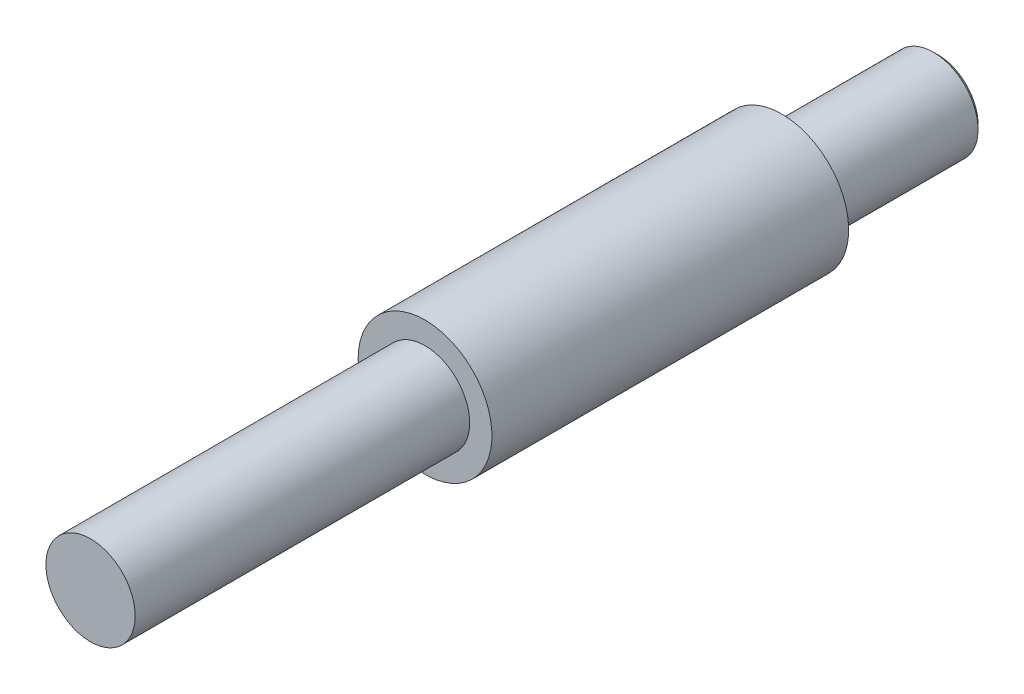
ISO-10303-21;
HEADER;
FILE_DESCRIPTION(('STEP AP214'),'2;1');
FILE_NAME('part.step','',(''),(''),'','','');
FILE_SCHEMA(('AUTOMOTIVE_DESIGN { 1 0 10303 214 1 1 1 1 }'));
ENDSEC;
DATA;
#1=APPLICATION_CONTEXT('core data for automotive mechanical design processes');
#2=APPLICATION_PROTOCOL_DEFINITION('international standard','automotive_design',2000,#1);
#3=PRODUCT_CONTEXT('',#1,'mechanical');
#4=PRODUCT('Part','Part','',(#3));
#5=PRODUCT_RELATED_PRODUCT_CATEGORY('part','',(#4));
#6=PRODUCT_DEFINITION_FORMATION('','',#4);
#7=PRODUCT_DEFINITION_CONTEXT('part definition',#1,'design');
#8=PRODUCT_DEFINITION('design','',#6,#7);
#9=PRODUCT_DEFINITION_SHAPE('','',#8);
#10=(LENGTH_UNIT() NAMED_UNIT(*) SI_UNIT(.MILLI.,.METRE.));
#11=(NAMED_UNIT(*) PLANE_ANGLE_UNIT() SI_UNIT($,.RADIAN.));
#12=(NAMED_UNIT(*) SI_UNIT($,.STERADIAN.) SOLID_ANGLE_UNIT());
#13=UNCERTAINTY_MEASURE_WITH_UNIT(LENGTH_MEASURE(1.E-05),#10,'distance_accuracy_value','');
#14=(GEOMETRIC_REPRESENTATION_CONTEXT(3) GLOBAL_UNCERTAINTY_ASSIGNED_CONTEXT((#13)) GLOBAL_UNIT_ASSIGNED_CONTEXT((#10,
#11,#12)) REPRESENTATION_CONTEXT('',''));
#15=CARTESIAN_POINT('',(0.,0.,0.));
#16=DIRECTION('',(0.,0.,1.));
#17=DIRECTION('',(1.,0.,0.));
#18=AXIS2_PLACEMENT_3D('',#15,#16,#17);
#19=CARTESIAN_POINT('',(0.,0.,-75.));
#20=DIRECTION('',(0.,0.,1.));
#21=DIRECTION('',(1.,0.,0.));
#22=AXIS2_PLACEMENT_3D('',#19,#20,#21);
#23=CYLINDRICAL_SURFACE('',#22,10.01);
#24=CARTESIAN_POINT('',(0.,0.,-75.));
#25=DIRECTION('',(0.,0.,1.));
#26=DIRECTION('',(1.,0.,0.));
#27=AXIS2_PLACEMENT_3D('',#24,#25,#26);
#28=CIRCLE('',#27,10.01);
#29=CARTESIAN_POINT('',(10.01,0.,-75.));
#30=VERTEX_POINT('',#29);
#31=EDGE_CURVE('E67',#30,#30,#28,.T.);
#32=ORIENTED_EDGE('',*,*,#31,.T.);
#33=EDGE_LOOP('',(#32));
#34=FACE_BOUND('',#33,.T.);
#35=CARTESIAN_POINT('',(0.,0.,0.));
#36=DIRECTION('',(0.,0.,1.));
#37=DIRECTION('',(1.,0.,0.));
#38=AXIS2_PLACEMENT_3D('',#35,#36,#37);
#39=CIRCLE('',#38,10.01);
#40=CARTESIAN_POINT('',(10.01,0.,0.));
#41=VERTEX_POINT('',#40);
#42=EDGE_CURVE('E61',#41,#41,#39,.T.);
#43=ORIENTED_EDGE('',*,*,#42,.F.);
#44=EDGE_LOOP('',(#43));
#45=FACE_BOUND('',#44,.T.);
#46=ADVANCED_FACE('F40',(#34,#45),#23,.T.);
#47=CARTESIAN_POINT('',(0.,0.,0.));
#48=DIRECTION('',(0.,0.,1.));
#49=DIRECTION('',(1.,0.,0.));
#50=AXIS2_PLACEMENT_3D('',#47,#48,#49);
#51=PLANE('',#50);
#52=ORIENTED_EDGE('',*,*,#42,.T.);
#53=EDGE_LOOP('',(#52));
#54=FACE_BOUND('',#53,.T.);
#55=ADVANCED_FACE('F86',(#54),#51,.T.);
#56=CARTESIAN_POINT('',(0.,0.,-155.));
#57=DIRECTION('',(0.,0.,1.));
#58=DIRECTION('',(1.,0.,0.));
#59=AXIS2_PLACEMENT_3D('',#56,#57,#58);
#60=CYLINDRICAL_SURFACE('',#59,15.);
#61=CARTESIAN_POINT('',(0.,0.,-155.));
#62=DIRECTION('',(0.,0.,-1.));
#63=DIRECTION('',(-1.,0.,0.));
#64=AXIS2_PLACEMENT_3D('',#61,#62,#63);
#65=CIRCLE('',#64,15.);
#66=CARTESIAN_POINT('',(-15.,0.,-155.));
#67=VERTEX_POINT('',#66);
#68=EDGE_CURVE('E71',#67,#67,#65,.T.);
#69=ORIENTED_EDGE('',*,*,#68,.F.);
#70=EDGE_LOOP('',(#69));
#71=FACE_BOUND('',#70,.T.);
#72=CARTESIAN_POINT('',(0.,0.,-75.));
#73=DIRECTION('',(0.,0.,-1.));
#74=DIRECTION('',(-1.,0.,0.));
#75=AXIS2_PLACEMENT_3D('',#72,#73,#74);
#76=CIRCLE('',#75,15.);
#77=CARTESIAN_POINT('',(-15.,0.,-75.));
#78=VERTEX_POINT('',#77);
#79=EDGE_CURVE('E72',#78,#78,#76,.T.);
#80=ORIENTED_EDGE('',*,*,#79,.T.);
#81=EDGE_LOOP('',(#80));
#82=FACE_BOUND('',#81,.T.);
#83=ADVANCED_FACE('F83',(#71,#82),#60,.T.);
#84=CARTESIAN_POINT('',(0.,0.,-155.));
#85=DIRECTION('',(0.,0.,-1.));
#86=DIRECTION('',(-1.,0.,0.));
#87=AXIS2_PLACEMENT_3D('',#84,#85,#86);
#88=PLANE('',#87);
#89=CARTESIAN_POINT('',(0.,0.,-155.));
#90=DIRECTION('',(0.,0.,-1.));
#91=DIRECTION('',(-1.,0.,0.));
#92=AXIS2_PLACEMENT_3D('',#89,#90,#91);
#93=CIRCLE('',#92,10.01);
#94=CARTESIAN_POINT('',(-10.01,0.,-155.));
#95=VERTEX_POINT('',#94);
#96=EDGE_CURVE('E55',#95,#95,#93,.T.);
#97=ORIENTED_EDGE('',*,*,#96,.F.);
#98=EDGE_LOOP('',(#97));
#99=FACE_BOUND('',#98,.T.);
#100=ORIENTED_EDGE('',*,*,#68,.T.);
#101=EDGE_LOOP('',(#100));
#102=FACE_BOUND('',#101,.T.);
#103=ADVANCED_FACE('F81',(#99,#102),#88,.T.);
#104=CARTESIAN_POINT('',(0.,0.,-75.));
#105=DIRECTION('',(0.,0.,-1.));
#106=DIRECTION('',(-1.,0.,0.));
#107=AXIS2_PLACEMENT_3D('',#104,#105,#106);
#108=PLANE('',#107);
#109=ORIENTED_EDGE('',*,*,#31,.F.);
#110=EDGE_LOOP('',(#109));
#111=FACE_BOUND('',#110,.T.);
#112=ORIENTED_EDGE('',*,*,#79,.F.);
#113=EDGE_LOOP('',(#112));
#114=FACE_BOUND('',#113,.T.);
#115=ADVANCED_FACE('F90',(#111,#114),#108,.F.);
#116=CARTESIAN_POINT('',(0.,0.,-190.));
#117=DIRECTION('',(0.,0.,1.));
#118=DIRECTION('',(1.,0.,0.));
#119=AXIS2_PLACEMENT_3D('',#116,#117,#118);
#120=CYLINDRICAL_SURFACE('',#119,10.01);
#121=CARTESIAN_POINT('',(0.,0.,-189.));
#122=DIRECTION('',(0.,0.,-1.));
#123=DIRECTION('',(-1.,0.,0.));
#124=AXIS2_PLACEMENT_3D('',#121,#122,#123);
#125=CIRCLE('',#124,10.01);
#126=CARTESIAN_POINT('',(-10.01,0.,-189.));
#127=VERTEX_POINT('',#126);
#128=EDGE_CURVE('E10',#127,#127,#125,.F.);
#129=ORIENTED_EDGE('',*,*,#128,.T.);
#130=EDGE_LOOP('',(#129));
#131=FACE_BOUND('',#130,.T.);
#132=ORIENTED_EDGE('',*,*,#96,.T.);
#133=EDGE_LOOP('',(#132));
#134=FACE_BOUND('',#133,.T.);
#135=ADVANCED_FACE('F92',(#131,#134),#120,.T.);
#136=CARTESIAN_POINT('',(0.,0.,-190.));
#137=DIRECTION('',(0.,0.,-1.));
#138=DIRECTION('',(-1.,0.,0.));
#139=AXIS2_PLACEMENT_3D('',#136,#137,#138);
#140=PLANE('',#139);
#141=CARTESIAN_POINT('',(0.,0.,-190.));
#142=DIRECTION('',(0.,0.,-1.));
#143=DIRECTION('',(-1.,0.,0.));
#144=AXIS2_PLACEMENT_3D('',#141,#142,#143);
#145=CIRCLE('',#144,9.00999999999999);
#146=CARTESIAN_POINT('',(-9.00999999999999,0.,-190.));
#147=VERTEX_POINT('',#146);
#148=EDGE_CURVE('E49',#147,#147,#145,.T.);
#149=ORIENTED_EDGE('',*,*,#148,.T.);
#150=EDGE_LOOP('',(#149));
#151=FACE_BOUND('',#150,.T.);
#152=ADVANCED_FACE('F99',(#151),#140,.T.);
#153=CARTESIAN_POINT('',(0.,0.,-190.));
#154=DIRECTION('',(0.,0.,1.));
#155=DIRECTION('',(1.,0.,0.));
#156=AXIS2_PLACEMENT_3D('',#153,#154,#155);
#157=CONICAL_SURFACE('',#156,9.00999999999999,0.785398163397439);
#158=ORIENTED_EDGE('',*,*,#128,.F.);
#159=EDGE_LOOP('',(#158));
#160=FACE_BOUND('',#159,.T.);
#161=ORIENTED_EDGE('',*,*,#148,.F.);
#162=EDGE_LOOP('',(#161));
#163=FACE_BOUND('',#162,.T.);
#164=ADVANCED_FACE('F43',(#160,#163),#157,.T.);
#165=CLOSED_SHELL('',(#46,#55,#83,#103,#115,#135,#152,#164));
#166=MANIFOLD_SOLID_BREP('B2',#165);
#167=ADVANCED_BREP_SHAPE_REPRESENTATION('',(#18,#166),#14);
#168=SHAPE_DEFINITION_REPRESENTATION(#9,#167);
ENDSEC;
END-ISO-10303-21;
